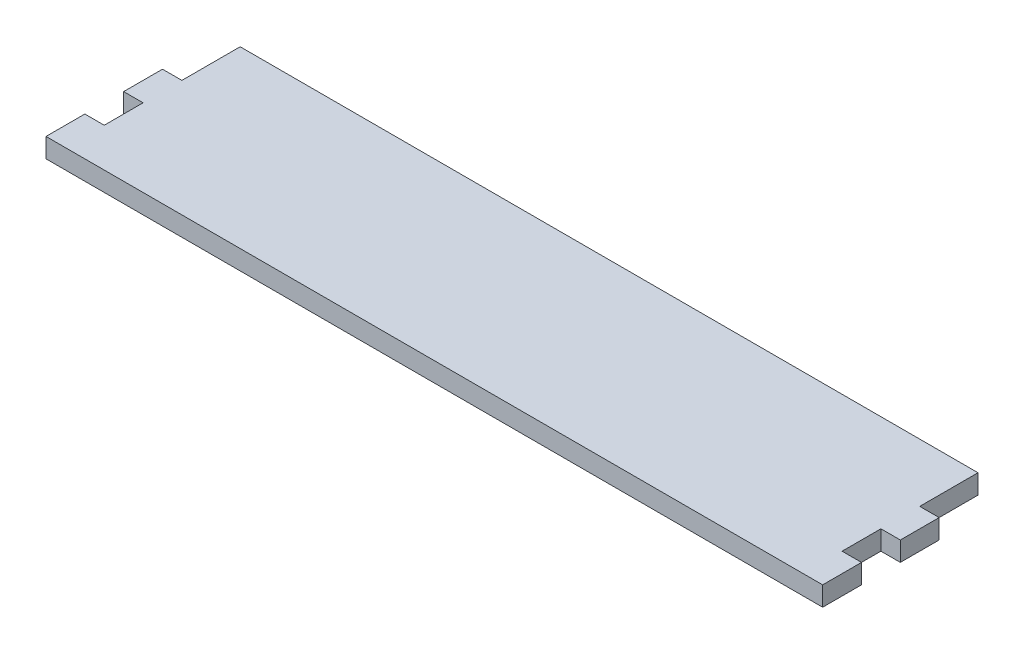
ISO-10303-21;
HEADER;
FILE_DESCRIPTION(('STEP AP214'),'2;1');
FILE_NAME('part.step','',(''),(''),'','','');
FILE_SCHEMA(('AUTOMOTIVE_DESIGN { 1 0 10303 214 1 1 1 1 }'));
ENDSEC;
DATA;
#1=APPLICATION_CONTEXT('core data for automotive mechanical design processes');
#2=APPLICATION_PROTOCOL_DEFINITION('international standard','automotive_design',2000,#1);
#3=PRODUCT_CONTEXT('',#1,'mechanical');
#4=PRODUCT('Part','Part','',(#3));
#5=PRODUCT_RELATED_PRODUCT_CATEGORY('part','',(#4));
#6=PRODUCT_DEFINITION_FORMATION('','',#4);
#7=PRODUCT_DEFINITION_CONTEXT('part definition',#1,'design');
#8=PRODUCT_DEFINITION('design','',#6,#7);
#9=PRODUCT_DEFINITION_SHAPE('','',#8);
#10=(LENGTH_UNIT() NAMED_UNIT(*) SI_UNIT(.MILLI.,.METRE.));
#11=(NAMED_UNIT(*) PLANE_ANGLE_UNIT() SI_UNIT($,.RADIAN.));
#12=(NAMED_UNIT(*) SI_UNIT($,.STERADIAN.) SOLID_ANGLE_UNIT());
#13=UNCERTAINTY_MEASURE_WITH_UNIT(LENGTH_MEASURE(1.E-05),#10,'distance_accuracy_value','');
#14=(GEOMETRIC_REPRESENTATION_CONTEXT(3) GLOBAL_UNCERTAINTY_ASSIGNED_CONTEXT((#13)) GLOBAL_UNIT_ASSIGNED_CONTEXT((#10,
#11,#12)) REPRESENTATION_CONTEXT('',''));
#15=CARTESIAN_POINT('',(0.,0.,0.));
#16=DIRECTION('',(0.,0.,1.));
#17=DIRECTION('',(1.,0.,0.));
#18=AXIS2_PLACEMENT_3D('',#15,#16,#17);
#19=CARTESIAN_POINT('',(100.,5.,22.5));
#20=DIRECTION('',(-1.,0.,0.));
#21=DIRECTION('',(0.,0.,1.));
#22=AXIS2_PLACEMENT_3D('',#19,#20,#21);
#23=PLANE('',#22);
#24=DIRECTION('',(0.,0.,-1.));
#25=VECTOR('',#24,1.);
#26=CARTESIAN_POINT('',(100.,0.,22.5));
#27=LINE('',#26,#25);
#28=CARTESIAN_POINT('',(100.,0.,22.5));
#29=VERTEX_POINT('',#28);
#30=CARTESIAN_POINT('',(100.,0.,12.5));
#31=VERTEX_POINT('',#30);
#32=EDGE_CURVE('E169',#29,#31,#27,.T.);
#33=ORIENTED_EDGE('',*,*,#32,.T.);
#34=DIRECTION('',(0.,1.,0.));
#35=VECTOR('',#34,1.);
#36=CARTESIAN_POINT('',(100.,0.,12.5));
#37=LINE('',#36,#35);
#38=CARTESIAN_POINT('',(100.,5.,12.5));
#39=VERTEX_POINT('',#38);
#40=EDGE_CURVE('E260',#31,#39,#37,.T.);
#41=ORIENTED_EDGE('',*,*,#40,.T.);
#42=DIRECTION('',(0.,0.,-1.));
#43=VECTOR('',#42,1.);
#44=CARTESIAN_POINT('',(100.,5.,22.5));
#45=LINE('',#44,#43);
#46=CARTESIAN_POINT('',(100.,5.,22.5));
#47=VERTEX_POINT('',#46);
#48=EDGE_CURVE('E204',#47,#39,#45,.T.);
#49=ORIENTED_EDGE('',*,*,#48,.F.);
#50=DIRECTION('',(0.,-1.,0.));
#51=VECTOR('',#50,1.);
#52=CARTESIAN_POINT('',(100.,5.,22.5));
#53=LINE('',#52,#51);
#54=EDGE_CURVE('E43',#47,#29,#53,.T.);
#55=ORIENTED_EDGE('',*,*,#54,.T.);
#56=EDGE_LOOP('',(#33,#41,#49,#55));
#57=FACE_BOUND('',#56,.T.);
#58=ADVANCED_FACE('F35',(#57),#23,.F.);
#59=CARTESIAN_POINT('',(-100.,5.,22.5));
#60=DIRECTION('',(1.,0.,0.));
#61=DIRECTION('',(0.,0.,-1.));
#62=AXIS2_PLACEMENT_3D('',#59,#60,#61);
#63=PLANE('',#62);
#64=DIRECTION('',(0.,0.,1.));
#65=VECTOR('',#64,1.);
#66=CARTESIAN_POINT('',(-100.,0.,22.5));
#67=LINE('',#66,#65);
#68=CARTESIAN_POINT('',(-100.,0.,-7.50000000000001));
#69=VERTEX_POINT('',#68);
#70=CARTESIAN_POINT('',(-100.,0.,2.49999999999999));
#71=VERTEX_POINT('',#70);
#72=EDGE_CURVE('E183',#69,#71,#67,.T.);
#73=ORIENTED_EDGE('',*,*,#72,.T.);
#74=DIRECTION('',(0.,1.,0.));
#75=VECTOR('',#74,1.);
#76=CARTESIAN_POINT('',(-100.,0.,2.49999999999999));
#77=LINE('',#76,#75);
#78=CARTESIAN_POINT('',(-100.,5.,2.49999999999999));
#79=VERTEX_POINT('',#78);
#80=EDGE_CURVE('E217',#71,#79,#77,.T.);
#81=ORIENTED_EDGE('',*,*,#80,.T.);
#82=DIRECTION('',(0.,0.,1.));
#83=VECTOR('',#82,1.);
#84=CARTESIAN_POINT('',(-100.,5.,22.5));
#85=LINE('',#84,#83);
#86=CARTESIAN_POINT('',(-100.,5.,-7.50000000000001));
#87=VERTEX_POINT('',#86);
#88=EDGE_CURVE('E192',#87,#79,#85,.T.);
#89=ORIENTED_EDGE('',*,*,#88,.F.);
#90=DIRECTION('',(0.,1.,0.));
#91=VECTOR('',#90,1.);
#92=CARTESIAN_POINT('',(-100.,0.,-7.50000000000001));
#93=LINE('',#92,#91);
#94=EDGE_CURVE('E206',#69,#87,#93,.T.);
#95=ORIENTED_EDGE('',*,*,#94,.F.);
#96=EDGE_LOOP('',(#73,#81,#89,#95));
#97=FACE_BOUND('',#96,.T.);
#98=ADVANCED_FACE('F303',(#97),#63,.F.);
#99=CARTESIAN_POINT('',(100.,5.,2.49999999999999));
#100=VERTEX_POINT('',#99);
#101=CARTESIAN_POINT('',(100.,5.,-7.50000000000001));
#102=VERTEX_POINT('',#101);
#103=EDGE_CURVE('E163',#100,#102,#45,.T.);
#104=ORIENTED_EDGE('',*,*,#103,.F.);
#105=DIRECTION('',(0.,1.,0.));
#106=VECTOR('',#105,1.);
#107=CARTESIAN_POINT('',(100.,0.,2.49999999999999));
#108=LINE('',#107,#106);
#109=CARTESIAN_POINT('',(100.,0.,2.49999999999999));
#110=VERTEX_POINT('',#109);
#111=EDGE_CURVE('E152',#110,#100,#108,.T.);
#112=ORIENTED_EDGE('',*,*,#111,.F.);
#113=CARTESIAN_POINT('',(100.,0.,-7.50000000000001));
#114=VERTEX_POINT('',#113);
#115=EDGE_CURVE('E162',#110,#114,#27,.T.);
#116=ORIENTED_EDGE('',*,*,#115,.T.);
#117=DIRECTION('',(0.,1.,0.));
#118=VECTOR('',#117,1.);
#119=CARTESIAN_POINT('',(100.,0.,-7.50000000000001));
#120=LINE('',#119,#118);
#121=EDGE_CURVE('E240',#114,#102,#120,.T.);
#122=ORIENTED_EDGE('',*,*,#121,.T.);
#123=EDGE_LOOP('',(#104,#112,#116,#122));
#124=FACE_BOUND('',#123,.T.);
#125=ADVANCED_FACE('F37',(#124),#23,.F.);
#126=CARTESIAN_POINT('',(-100.,5.,-22.5));
#127=DIRECTION('',(0.,0.,1.));
#128=DIRECTION('',(1.,0.,0.));
#129=AXIS2_PLACEMENT_3D('',#126,#127,#128);
#130=PLANE('',#129);
#131=DIRECTION('',(-1.,0.,0.));
#132=VECTOR('',#131,1.);
#133=CARTESIAN_POINT('',(-100.,5.,-22.5));
#134=LINE('',#133,#132);
#135=CARTESIAN_POINT('',(95.,5.,-22.5));
#136=VERTEX_POINT('',#135);
#137=CARTESIAN_POINT('',(-95.,5.,-22.5));
#138=VERTEX_POINT('',#137);
#139=EDGE_CURVE('E201',#136,#138,#134,.T.);
#140=ORIENTED_EDGE('',*,*,#139,.F.);
#141=DIRECTION('',(0.,1.,0.));
#142=VECTOR('',#141,1.);
#143=CARTESIAN_POINT('',(95.,0.,-22.5));
#144=LINE('',#143,#142);
#145=CARTESIAN_POINT('',(95.,0.,-22.5));
#146=VERTEX_POINT('',#145);
#147=EDGE_CURVE('E248',#146,#136,#144,.T.);
#148=ORIENTED_EDGE('',*,*,#147,.F.);
#149=DIRECTION('',(-1.,0.,0.));
#150=VECTOR('',#149,1.);
#151=CARTESIAN_POINT('',(-100.,0.,-22.5));
#152=LINE('',#151,#150);
#153=CARTESIAN_POINT('',(-95.,0.,-22.5));
#154=VERTEX_POINT('',#153);
#155=EDGE_CURVE('E173',#146,#154,#152,.T.);
#156=ORIENTED_EDGE('',*,*,#155,.T.);
#157=DIRECTION('',(0.,1.,0.));
#158=VECTOR('',#157,1.);
#159=CARTESIAN_POINT('',(-95.,0.,-22.5));
#160=LINE('',#159,#158);
#161=EDGE_CURVE('E170',#154,#138,#160,.T.);
#162=ORIENTED_EDGE('',*,*,#161,.T.);
#163=EDGE_LOOP('',(#140,#148,#156,#162));
#164=FACE_BOUND('',#163,.T.);
#165=ADVANCED_FACE('F292',(#164),#130,.F.);
#166=CARTESIAN_POINT('',(-100.,5.,12.5));
#167=VERTEX_POINT('',#166);
#168=CARTESIAN_POINT('',(-100.,5.,22.5));
#169=VERTEX_POINT('',#168);
#170=EDGE_CURVE('E197',#167,#169,#85,.T.);
#171=ORIENTED_EDGE('',*,*,#170,.F.);
#172=DIRECTION('',(0.,1.,0.));
#173=VECTOR('',#172,1.);
#174=CARTESIAN_POINT('',(-100.,0.,12.5));
#175=LINE('',#174,#173);
#176=CARTESIAN_POINT('',(-100.,0.,12.5));
#177=VERTEX_POINT('',#176);
#178=EDGE_CURVE('E222',#177,#167,#175,.T.);
#179=ORIENTED_EDGE('',*,*,#178,.F.);
#180=CARTESIAN_POINT('',(-100.,0.,22.5));
#181=VERTEX_POINT('',#180);
#182=EDGE_CURVE('E182',#177,#181,#67,.T.);
#183=ORIENTED_EDGE('',*,*,#182,.T.);
#184=DIRECTION('',(0.,-1.,0.));
#185=VECTOR('',#184,1.);
#186=CARTESIAN_POINT('',(-100.,5.,22.5));
#187=LINE('',#186,#185);
#188=EDGE_CURVE('E11',#169,#181,#187,.T.);
#189=ORIENTED_EDGE('',*,*,#188,.F.);
#190=EDGE_LOOP('',(#171,#179,#183,#189));
#191=FACE_BOUND('',#190,.T.);
#192=ADVANCED_FACE('F319',(#191),#63,.F.);
#193=CARTESIAN_POINT('',(-100.,5.,22.5));
#194=DIRECTION('',(0.,0.,-1.));
#195=DIRECTION('',(-1.,0.,0.));
#196=AXIS2_PLACEMENT_3D('',#193,#194,#195);
#197=PLANE('',#196);
#198=DIRECTION('',(1.,0.,0.));
#199=VECTOR('',#198,1.);
#200=CARTESIAN_POINT('',(-100.,0.,22.5));
#201=LINE('',#200,#199);
#202=EDGE_CURVE('E186',#181,#29,#201,.T.);
#203=ORIENTED_EDGE('',*,*,#202,.T.);
#204=ORIENTED_EDGE('',*,*,#54,.F.);
#205=DIRECTION('',(1.,0.,0.));
#206=VECTOR('',#205,1.);
#207=CARTESIAN_POINT('',(-100.,5.,22.5));
#208=LINE('',#207,#206);
#209=EDGE_CURVE('E179',#169,#47,#208,.T.);
#210=ORIENTED_EDGE('',*,*,#209,.F.);
#211=ORIENTED_EDGE('',*,*,#188,.T.);
#212=EDGE_LOOP('',(#203,#204,#210,#211));
#213=FACE_BOUND('',#212,.T.);
#214=ADVANCED_FACE('F321',(#213),#197,.F.);
#215=CARTESIAN_POINT('',(0.,5.,0.));
#216=DIRECTION('',(0.,-1.,0.));
#217=DIRECTION('',(0.,0.,-1.));
#218=AXIS2_PLACEMENT_3D('',#215,#216,#217);
#219=PLANE('',#218);
#220=ORIENTED_EDGE('',*,*,#48,.T.);
#221=DIRECTION('',(1.,0.,0.));
#222=VECTOR('',#221,1.);
#223=CARTESIAN_POINT('',(100.,5.,12.5));
#224=LINE('',#223,#222);
#225=CARTESIAN_POINT('',(95.,5.,12.5));
#226=VERTEX_POINT('',#225);
#227=EDGE_CURVE('E157',#226,#39,#224,.T.);
#228=ORIENTED_EDGE('',*,*,#227,.F.);
#229=DIRECTION('',(0.,0.,1.));
#230=VECTOR('',#229,1.);
#231=CARTESIAN_POINT('',(95.,5.,12.5));
#232=LINE('',#231,#230);
#233=CARTESIAN_POINT('',(95.,5.,2.49999999999999));
#234=VERTEX_POINT('',#233);
#235=EDGE_CURVE('E269',#234,#226,#232,.T.);
#236=ORIENTED_EDGE('',*,*,#235,.F.);
#237=DIRECTION('',(-1.,0.,0.));
#238=VECTOR('',#237,1.);
#239=CARTESIAN_POINT('',(100.,5.,2.49999999999999));
#240=LINE('',#239,#238);
#241=EDGE_CURVE('E272',#100,#234,#240,.T.);
#242=ORIENTED_EDGE('',*,*,#241,.F.);
#243=ORIENTED_EDGE('',*,*,#103,.T.);
#244=DIRECTION('',(1.,0.,0.));
#245=VECTOR('',#244,1.);
#246=CARTESIAN_POINT('',(100.,5.,-7.50000000000001));
#247=LINE('',#246,#245);
#248=CARTESIAN_POINT('',(95.,5.,-7.50000000000001));
#249=VERTEX_POINT('',#248);
#250=EDGE_CURVE('E253',#249,#102,#247,.T.);
#251=ORIENTED_EDGE('',*,*,#250,.F.);
#252=DIRECTION('',(0.,0.,1.));
#253=VECTOR('',#252,1.);
#254=CARTESIAN_POINT('',(95.,5.,-22.5));
#255=LINE('',#254,#253);
#256=EDGE_CURVE('E257',#136,#249,#255,.T.);
#257=ORIENTED_EDGE('',*,*,#256,.F.);
#258=ORIENTED_EDGE('',*,*,#139,.T.);
#259=DIRECTION('',(0.,0.,-1.));
#260=VECTOR('',#259,1.);
#261=CARTESIAN_POINT('',(-95.,5.,-22.5));
#262=LINE('',#261,#260);
#263=CARTESIAN_POINT('',(-95.,5.,-7.50000000000001));
#264=VERTEX_POINT('',#263);
#265=EDGE_CURVE('E210',#264,#138,#262,.T.);
#266=ORIENTED_EDGE('',*,*,#265,.F.);
#267=DIRECTION('',(1.,0.,0.));
#268=VECTOR('',#267,1.);
#269=CARTESIAN_POINT('',(-100.,5.,-7.50000000000001));
#270=LINE('',#269,#268);
#271=EDGE_CURVE('E214',#87,#264,#270,.T.);
#272=ORIENTED_EDGE('',*,*,#271,.F.);
#273=ORIENTED_EDGE('',*,*,#88,.T.);
#274=DIRECTION('',(-1.,0.,0.));
#275=VECTOR('',#274,1.);
#276=CARTESIAN_POINT('',(-100.,5.,2.49999999999999));
#277=LINE('',#276,#275);
#278=CARTESIAN_POINT('',(-95.,5.,2.49999999999999));
#279=VERTEX_POINT('',#278);
#280=EDGE_CURVE('E231',#279,#79,#277,.T.);
#281=ORIENTED_EDGE('',*,*,#280,.F.);
#282=DIRECTION('',(0.,0.,-1.));
#283=VECTOR('',#282,1.);
#284=CARTESIAN_POINT('',(-95.,5.,2.49999999999999));
#285=LINE('',#284,#283);
#286=CARTESIAN_POINT('',(-95.,5.,12.5));
#287=VERTEX_POINT('',#286);
#288=EDGE_CURVE('E234',#287,#279,#285,.T.);
#289=ORIENTED_EDGE('',*,*,#288,.F.);
#290=DIRECTION('',(1.,0.,0.));
#291=VECTOR('',#290,1.);
#292=CARTESIAN_POINT('',(-100.,5.,12.5));
#293=LINE('',#292,#291);
#294=EDGE_CURVE('E237',#167,#287,#293,.T.);
#295=ORIENTED_EDGE('',*,*,#294,.F.);
#296=ORIENTED_EDGE('',*,*,#170,.T.);
#297=ORIENTED_EDGE('',*,*,#209,.T.);
#298=EDGE_LOOP('',(#220,#228,#236,#242,#243,#251,#257,#258,#266,#272,#273,#281,#289,#295,#296,#297));
#299=FACE_BOUND('',#298,.T.);
#300=ADVANCED_FACE('F279',(#299),#219,.F.);
#301=CARTESIAN_POINT('',(0.,0.,0.));
#302=DIRECTION('',(0.,-1.,0.));
#303=DIRECTION('',(0.,0.,-1.));
#304=AXIS2_PLACEMENT_3D('',#301,#302,#303);
#305=PLANE('',#304);
#306=DIRECTION('',(1.,0.,0.));
#307=VECTOR('',#306,1.);
#308=CARTESIAN_POINT('',(100.,0.,12.5));
#309=LINE('',#308,#307);
#310=CARTESIAN_POINT('',(95.,0.,12.5));
#311=VERTEX_POINT('',#310);
#312=EDGE_CURVE('E164',#311,#31,#309,.T.);
#313=ORIENTED_EDGE('',*,*,#312,.T.);
#314=ORIENTED_EDGE('',*,*,#32,.F.);
#315=ORIENTED_EDGE('',*,*,#202,.F.);
#316=ORIENTED_EDGE('',*,*,#182,.F.);
#317=DIRECTION('',(1.,0.,0.));
#318=VECTOR('',#317,1.);
#319=CARTESIAN_POINT('',(-100.,0.,12.5));
#320=LINE('',#319,#318);
#321=CARTESIAN_POINT('',(-95.,0.,12.5));
#322=VERTEX_POINT('',#321);
#323=EDGE_CURVE('E233',#177,#322,#320,.T.);
#324=ORIENTED_EDGE('',*,*,#323,.T.);
#325=DIRECTION('',(0.,0.,-1.));
#326=VECTOR('',#325,1.);
#327=CARTESIAN_POINT('',(-95.,0.,2.49999999999999));
#328=LINE('',#327,#326);
#329=CARTESIAN_POINT('',(-95.,0.,2.49999999999999));
#330=VERTEX_POINT('',#329);
#331=EDGE_CURVE('E243',#322,#330,#328,.T.);
#332=ORIENTED_EDGE('',*,*,#331,.T.);
#333=DIRECTION('',(-1.,0.,0.));
#334=VECTOR('',#333,1.);
#335=CARTESIAN_POINT('',(-100.,0.,2.49999999999999));
#336=LINE('',#335,#334);
#337=EDGE_CURVE('E225',#330,#71,#336,.T.);
#338=ORIENTED_EDGE('',*,*,#337,.T.);
#339=ORIENTED_EDGE('',*,*,#72,.F.);
#340=DIRECTION('',(1.,0.,0.));
#341=VECTOR('',#340,1.);
#342=CARTESIAN_POINT('',(-100.,0.,-7.50000000000001));
#343=LINE('',#342,#341);
#344=CARTESIAN_POINT('',(-95.,0.,-7.50000000000001));
#345=VERTEX_POINT('',#344);
#346=EDGE_CURVE('E213',#69,#345,#343,.T.);
#347=ORIENTED_EDGE('',*,*,#346,.T.);
#348=DIRECTION('',(0.,0.,-1.));
#349=VECTOR('',#348,1.);
#350=CARTESIAN_POINT('',(-95.,0.,-22.5));
#351=LINE('',#350,#349);
#352=EDGE_CURVE('E208',#345,#154,#351,.T.);
#353=ORIENTED_EDGE('',*,*,#352,.T.);
#354=ORIENTED_EDGE('',*,*,#155,.F.);
#355=DIRECTION('',(0.,0.,1.));
#356=VECTOR('',#355,1.);
#357=CARTESIAN_POINT('',(95.,0.,-22.5));
#358=LINE('',#357,#356);
#359=CARTESIAN_POINT('',(95.,0.,-7.50000000000001));
#360=VERTEX_POINT('',#359);
#361=EDGE_CURVE('E256',#146,#360,#358,.T.);
#362=ORIENTED_EDGE('',*,*,#361,.T.);
#363=DIRECTION('',(1.,0.,0.));
#364=VECTOR('',#363,1.);
#365=CARTESIAN_POINT('',(100.,0.,-7.50000000000001));
#366=LINE('',#365,#364);
#367=EDGE_CURVE('E58',#360,#114,#366,.T.);
#368=ORIENTED_EDGE('',*,*,#367,.T.);
#369=ORIENTED_EDGE('',*,*,#115,.F.);
#370=DIRECTION('',(-1.,0.,0.));
#371=VECTOR('',#370,1.);
#372=CARTESIAN_POINT('',(100.,0.,2.49999999999999));
#373=LINE('',#372,#371);
#374=CARTESIAN_POINT('',(95.,0.,2.49999999999999));
#375=VERTEX_POINT('',#374);
#376=EDGE_CURVE('E148',#110,#375,#373,.T.);
#377=ORIENTED_EDGE('',*,*,#376,.T.);
#378=DIRECTION('',(0.,0.,1.));
#379=VECTOR('',#378,1.);
#380=CARTESIAN_POINT('',(95.,0.,12.5));
#381=LINE('',#380,#379);
#382=EDGE_CURVE('E50',#375,#311,#381,.T.);
#383=ORIENTED_EDGE('',*,*,#382,.T.);
#384=EDGE_LOOP('',(#313,#314,#315,#316,#324,#332,#338,#339,#347,#353,#354,#362,#368,#369,#377,#383));
#385=FACE_BOUND('',#384,.T.);
#386=ADVANCED_FACE('F167',(#385),#305,.T.);
#387=CARTESIAN_POINT('',(-95.,0.,-22.5));
#388=DIRECTION('',(1.,0.,0.));
#389=DIRECTION('',(0.,0.,-1.));
#390=AXIS2_PLACEMENT_3D('',#387,#388,#389);
#391=PLANE('',#390);
#392=ORIENTED_EDGE('',*,*,#265,.T.);
#393=ORIENTED_EDGE('',*,*,#161,.F.);
#394=ORIENTED_EDGE('',*,*,#352,.F.);
#395=DIRECTION('',(0.,1.,0.));
#396=VECTOR('',#395,1.);
#397=CARTESIAN_POINT('',(-95.,0.,-7.50000000000001));
#398=LINE('',#397,#396);
#399=EDGE_CURVE('E175',#345,#264,#398,.T.);
#400=ORIENTED_EDGE('',*,*,#399,.T.);
#401=EDGE_LOOP('',(#392,#393,#394,#400));
#402=FACE_BOUND('',#401,.T.);
#403=ADVANCED_FACE('F296',(#402),#391,.F.);
#404=CARTESIAN_POINT('',(-100.,0.,-7.50000000000001));
#405=DIRECTION('',(0.,0.,1.));
#406=DIRECTION('',(1.,0.,0.));
#407=AXIS2_PLACEMENT_3D('',#404,#405,#406);
#408=PLANE('',#407);
#409=ORIENTED_EDGE('',*,*,#271,.T.);
#410=ORIENTED_EDGE('',*,*,#399,.F.);
#411=ORIENTED_EDGE('',*,*,#346,.F.);
#412=ORIENTED_EDGE('',*,*,#94,.T.);
#413=EDGE_LOOP('',(#409,#410,#411,#412));
#414=FACE_BOUND('',#413,.T.);
#415=ADVANCED_FACE('F301',(#414),#408,.F.);
#416=CARTESIAN_POINT('',(-100.,0.,2.49999999999999));
#417=DIRECTION('',(0.,0.,-1.));
#418=DIRECTION('',(-1.,0.,0.));
#419=AXIS2_PLACEMENT_3D('',#416,#417,#418);
#420=PLANE('',#419);
#421=ORIENTED_EDGE('',*,*,#280,.T.);
#422=ORIENTED_EDGE('',*,*,#80,.F.);
#423=ORIENTED_EDGE('',*,*,#337,.F.);
#424=DIRECTION('',(0.,1.,0.));
#425=VECTOR('',#424,1.);
#426=CARTESIAN_POINT('',(-95.,0.,2.49999999999999));
#427=LINE('',#426,#425);
#428=EDGE_CURVE('E227',#330,#279,#427,.T.);
#429=ORIENTED_EDGE('',*,*,#428,.T.);
#430=EDGE_LOOP('',(#421,#422,#423,#429));
#431=FACE_BOUND('',#430,.T.);
#432=ADVANCED_FACE('F306',(#431),#420,.F.);
#433=CARTESIAN_POINT('',(-95.,0.,2.49999999999999));
#434=DIRECTION('',(1.,0.,0.));
#435=DIRECTION('',(0.,0.,-1.));
#436=AXIS2_PLACEMENT_3D('',#433,#434,#435);
#437=PLANE('',#436);
#438=ORIENTED_EDGE('',*,*,#288,.T.);
#439=ORIENTED_EDGE('',*,*,#428,.F.);
#440=ORIENTED_EDGE('',*,*,#331,.F.);
#441=DIRECTION('',(0.,1.,0.));
#442=VECTOR('',#441,1.);
#443=CARTESIAN_POINT('',(-95.,0.,12.5));
#444=LINE('',#443,#442);
#445=EDGE_CURVE('E224',#322,#287,#444,.T.);
#446=ORIENTED_EDGE('',*,*,#445,.T.);
#447=EDGE_LOOP('',(#438,#439,#440,#446));
#448=FACE_BOUND('',#447,.T.);
#449=ADVANCED_FACE('F310',(#448),#437,.F.);
#450=CARTESIAN_POINT('',(-100.,0.,12.5));
#451=DIRECTION('',(0.,0.,1.));
#452=DIRECTION('',(1.,0.,0.));
#453=AXIS2_PLACEMENT_3D('',#450,#451,#452);
#454=PLANE('',#453);
#455=ORIENTED_EDGE('',*,*,#294,.T.);
#456=ORIENTED_EDGE('',*,*,#445,.F.);
#457=ORIENTED_EDGE('',*,*,#323,.F.);
#458=ORIENTED_EDGE('',*,*,#178,.T.);
#459=EDGE_LOOP('',(#455,#456,#457,#458));
#460=FACE_BOUND('',#459,.T.);
#461=ADVANCED_FACE('F312',(#460),#454,.F.);
#462=CARTESIAN_POINT('',(100.,0.,-7.50000000000001));
#463=DIRECTION('',(0.,0.,1.));
#464=DIRECTION('',(1.,0.,0.));
#465=AXIS2_PLACEMENT_3D('',#462,#463,#464);
#466=PLANE('',#465);
#467=ORIENTED_EDGE('',*,*,#250,.T.);
#468=ORIENTED_EDGE('',*,*,#121,.F.);
#469=ORIENTED_EDGE('',*,*,#367,.F.);
#470=DIRECTION('',(0.,1.,0.));
#471=VECTOR('',#470,1.);
#472=CARTESIAN_POINT('',(95.,0.,-7.50000000000001));
#473=LINE('',#472,#471);
#474=EDGE_CURVE('E250',#360,#249,#473,.T.);
#475=ORIENTED_EDGE('',*,*,#474,.T.);
#476=EDGE_LOOP('',(#467,#468,#469,#475));
#477=FACE_BOUND('',#476,.T.);
#478=ADVANCED_FACE('F285',(#477),#466,.F.);
#479=CARTESIAN_POINT('',(95.,0.,-22.5));
#480=DIRECTION('',(-1.,0.,0.));
#481=DIRECTION('',(0.,0.,1.));
#482=AXIS2_PLACEMENT_3D('',#479,#480,#481);
#483=PLANE('',#482);
#484=ORIENTED_EDGE('',*,*,#256,.T.);
#485=ORIENTED_EDGE('',*,*,#474,.F.);
#486=ORIENTED_EDGE('',*,*,#361,.F.);
#487=ORIENTED_EDGE('',*,*,#147,.T.);
#488=EDGE_LOOP('',(#484,#485,#486,#487));
#489=FACE_BOUND('',#488,.T.);
#490=ADVANCED_FACE('F287',(#489),#483,.F.);
#491=CARTESIAN_POINT('',(100.,0.,12.5));
#492=DIRECTION('',(0.,0.,1.));
#493=DIRECTION('',(1.,0.,0.));
#494=AXIS2_PLACEMENT_3D('',#491,#492,#493);
#495=PLANE('',#494);
#496=ORIENTED_EDGE('',*,*,#227,.T.);
#497=ORIENTED_EDGE('',*,*,#40,.F.);
#498=ORIENTED_EDGE('',*,*,#312,.F.);
#499=DIRECTION('',(0.,1.,0.));
#500=VECTOR('',#499,1.);
#501=CARTESIAN_POINT('',(95.,0.,12.5));
#502=LINE('',#501,#500);
#503=EDGE_CURVE('E264',#311,#226,#502,.T.);
#504=ORIENTED_EDGE('',*,*,#503,.T.);
#505=EDGE_LOOP('',(#496,#497,#498,#504));
#506=FACE_BOUND('',#505,.T.);
#507=ADVANCED_FACE('F281',(#506),#495,.F.);
#508=CARTESIAN_POINT('',(95.,0.,12.5));
#509=DIRECTION('',(-1.,0.,0.));
#510=DIRECTION('',(0.,0.,1.));
#511=AXIS2_PLACEMENT_3D('',#508,#509,#510);
#512=PLANE('',#511);
#513=ORIENTED_EDGE('',*,*,#235,.T.);
#514=ORIENTED_EDGE('',*,*,#503,.F.);
#515=ORIENTED_EDGE('',*,*,#382,.F.);
#516=DIRECTION('',(0.,1.,0.));
#517=VECTOR('',#516,1.);
#518=CARTESIAN_POINT('',(95.,0.,2.49999999999999));
#519=LINE('',#518,#517);
#520=EDGE_CURVE('E154',#375,#234,#519,.T.);
#521=ORIENTED_EDGE('',*,*,#520,.T.);
#522=EDGE_LOOP('',(#513,#514,#515,#521));
#523=FACE_BOUND('',#522,.T.);
#524=ADVANCED_FACE('F282',(#523),#512,.F.);
#525=CARTESIAN_POINT('',(100.,0.,2.49999999999999));
#526=DIRECTION('',(0.,0.,-1.));
#527=DIRECTION('',(-1.,0.,0.));
#528=AXIS2_PLACEMENT_3D('',#525,#526,#527);
#529=PLANE('',#528);
#530=ORIENTED_EDGE('',*,*,#241,.T.);
#531=ORIENTED_EDGE('',*,*,#520,.F.);
#532=ORIENTED_EDGE('',*,*,#376,.F.);
#533=ORIENTED_EDGE('',*,*,#111,.T.);
#534=EDGE_LOOP('',(#530,#531,#532,#533));
#535=FACE_BOUND('',#534,.T.);
#536=ADVANCED_FACE('F151',(#535),#529,.F.);
#537=CLOSED_SHELL('',(#58,#98,#125,#165,#192,#214,#300,#386,#403,#415,#432,#449,#461,#478,#490,
#507,#524,#536));
#538=MANIFOLD_SOLID_BREP('B2',#537);
#539=ADVANCED_BREP_SHAPE_REPRESENTATION('',(#18,#538),#14);
#540=SHAPE_DEFINITION_REPRESENTATION(#9,#539);
ENDSEC;
END-ISO-10303-21;
